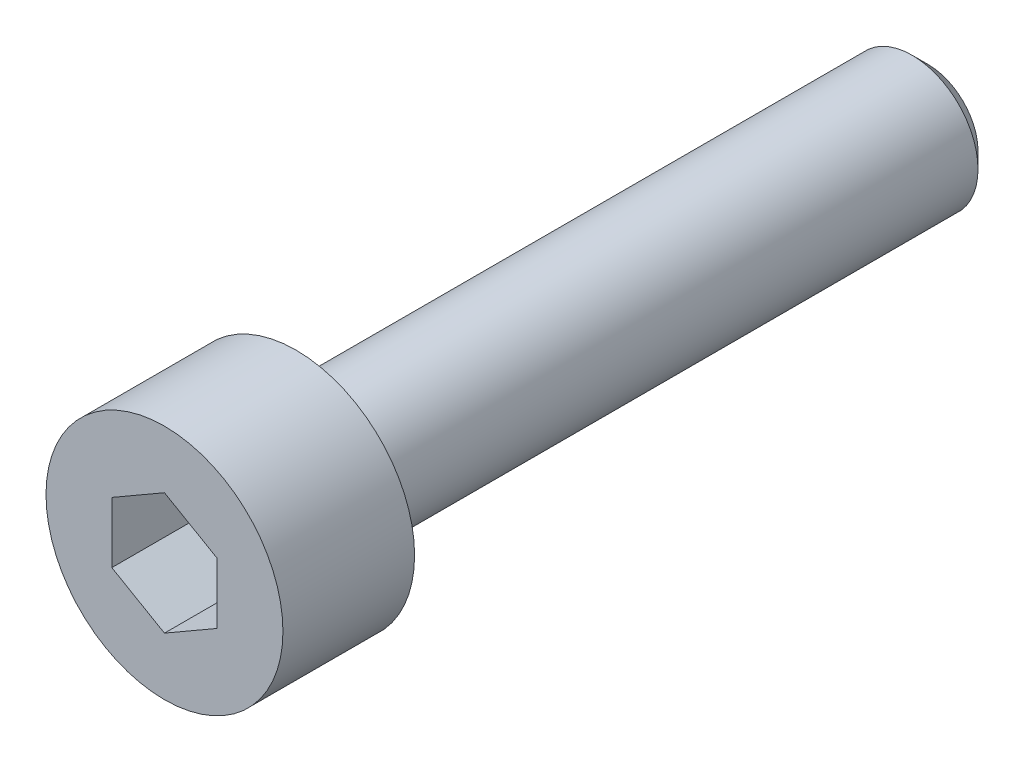
ISO-10303-21;
HEADER;
FILE_DESCRIPTION(('STEP AP214'),'2;1');
FILE_NAME('part.step','',(''),(''),'','','');
FILE_SCHEMA(('AUTOMOTIVE_DESIGN { 1 0 10303 214 1 1 1 1 }'));
ENDSEC;
DATA;
#1=APPLICATION_CONTEXT('core data for automotive mechanical design processes');
#2=APPLICATION_PROTOCOL_DEFINITION('international standard','automotive_design',2000,#1);
#3=PRODUCT_CONTEXT('',#1,'mechanical');
#4=PRODUCT('Part','Part','',(#3));
#5=PRODUCT_RELATED_PRODUCT_CATEGORY('part','',(#4));
#6=PRODUCT_DEFINITION_FORMATION('','',#4);
#7=PRODUCT_DEFINITION_CONTEXT('part definition',#1,'design');
#8=PRODUCT_DEFINITION('design','',#6,#7);
#9=PRODUCT_DEFINITION_SHAPE('','',#8);
#10=(LENGTH_UNIT() NAMED_UNIT(*) SI_UNIT(.MILLI.,.METRE.));
#11=(NAMED_UNIT(*) PLANE_ANGLE_UNIT() SI_UNIT($,.RADIAN.));
#12=(NAMED_UNIT(*) SI_UNIT($,.STERADIAN.) SOLID_ANGLE_UNIT());
#13=UNCERTAINTY_MEASURE_WITH_UNIT(LENGTH_MEASURE(1.E-05),#10,'distance_accuracy_value','');
#14=(GEOMETRIC_REPRESENTATION_CONTEXT(3) GLOBAL_UNCERTAINTY_ASSIGNED_CONTEXT((#13)) GLOBAL_UNIT_ASSIGNED_CONTEXT((#10,
#11,#12)) REPRESENTATION_CONTEXT('',''));
#15=CARTESIAN_POINT('',(0.,0.,0.));
#16=DIRECTION('',(0.,0.,1.));
#17=DIRECTION('',(1.,0.,0.));
#18=AXIS2_PLACEMENT_3D('',#15,#16,#17);
#19=CARTESIAN_POINT('',(0.,0.,0.));
#20=DIRECTION('',(0.,0.,1.));
#21=DIRECTION('',(1.,0.,0.));
#22=AXIS2_PLACEMENT_3D('',#19,#20,#21);
#23=PLANE('',#22);
#24=CARTESIAN_POINT('',(0.,0.,0.));
#25=DIRECTION('',(0.,0.,1.));
#26=DIRECTION('',(1.,0.,0.));
#27=AXIS2_PLACEMENT_3D('',#24,#25,#26);
#28=CIRCLE('',#27,2.25);
#29=CARTESIAN_POINT('',(2.25,0.,0.));
#30=VERTEX_POINT('',#29);
#31=EDGE_CURVE('E135',#30,#30,#28,.T.);
#32=ORIENTED_EDGE('',*,*,#31,.F.);
#33=EDGE_LOOP('',(#32));
#34=FACE_BOUND('',#33,.T.);
#35=CARTESIAN_POINT('',(0.,0.,0.));
#36=DIRECTION('',(0.,0.,1.));
#37=DIRECTION('',(1.,0.,0.));
#38=AXIS2_PLACEMENT_3D('',#35,#36,#37);
#39=CIRCLE('',#38,1.25);
#40=CARTESIAN_POINT('',(1.25,0.,0.));
#41=VERTEX_POINT('',#40);
#42=EDGE_CURVE('E144',#41,#41,#39,.F.);
#43=ORIENTED_EDGE('',*,*,#42,.F.);
#44=EDGE_LOOP('',(#43));
#45=FACE_BOUND('',#44,.T.);
#46=ADVANCED_FACE('F33',(#34,#45),#23,.F.);
#47=CARTESIAN_POINT('',(0.,0.,2.5));
#48=DIRECTION('',(0.,0.,-1.));
#49=DIRECTION('',(-1.,0.,0.));
#50=AXIS2_PLACEMENT_3D('',#47,#48,#49);
#51=CYLINDRICAL_SURFACE('',#50,2.25);
#52=CARTESIAN_POINT('',(0.,0.,2.5));
#53=DIRECTION('',(0.,0.,1.));
#54=DIRECTION('',(1.,0.,0.));
#55=AXIS2_PLACEMENT_3D('',#52,#53,#54);
#56=CIRCLE('',#55,2.25);
#57=CARTESIAN_POINT('',(2.25,0.,2.5));
#58=VERTEX_POINT('',#57);
#59=EDGE_CURVE('E141',#58,#58,#56,.T.);
#60=ORIENTED_EDGE('',*,*,#59,.F.);
#61=EDGE_LOOP('',(#60));
#62=FACE_BOUND('',#61,.T.);
#63=ORIENTED_EDGE('',*,*,#31,.T.);
#64=EDGE_LOOP('',(#63));
#65=FACE_BOUND('',#64,.T.);
#66=ADVANCED_FACE('F166',(#62,#65),#51,.T.);
#67=CARTESIAN_POINT('',(0.,0.,2.5));
#68=DIRECTION('',(0.,0.,1.));
#69=DIRECTION('',(1.,0.,0.));
#70=AXIS2_PLACEMENT_3D('',#67,#68,#69);
#71=PLANE('',#70);
#72=DIRECTION('',(-0.866025403784439,0.5,0.));
#73=VECTOR('',#72,1.);
#74=CARTESIAN_POINT('',(0.999999999999999,0.577350269189626,2.5));
#75=LINE('',#74,#73);
#76=CARTESIAN_POINT('',(0.999999999999999,0.577350269189626,2.5));
#77=VERTEX_POINT('',#76);
#78=CARTESIAN_POINT('',(0.,1.15470053837925,2.5));
#79=VERTEX_POINT('',#78);
#80=EDGE_CURVE('E48',#77,#79,#75,.T.);
#81=ORIENTED_EDGE('',*,*,#80,.F.);
#82=DIRECTION('',(0.,1.,0.));
#83=VECTOR('',#82,1.);
#84=CARTESIAN_POINT('',(0.999999999999999,-0.577350269189626,2.5));
#85=LINE('',#84,#83);
#86=CARTESIAN_POINT('',(0.999999999999999,-0.577350269189626,2.5));
#87=VERTEX_POINT('',#86);
#88=EDGE_CURVE('E131',#87,#77,#85,.T.);
#89=ORIENTED_EDGE('',*,*,#88,.F.);
#90=DIRECTION('',(0.866025403784439,0.5,0.));
#91=VECTOR('',#90,1.);
#92=CARTESIAN_POINT('',(0.,-1.15470053837925,2.5));
#93=LINE('',#92,#91);
#94=CARTESIAN_POINT('',(0.,-1.15470053837925,2.5));
#95=VERTEX_POINT('',#94);
#96=EDGE_CURVE('E129',#95,#87,#93,.T.);
#97=ORIENTED_EDGE('',*,*,#96,.F.);
#98=DIRECTION('',(0.866025403784438,-0.5,0.));
#99=VECTOR('',#98,1.);
#100=CARTESIAN_POINT('',(-1.,-0.577350269189626,2.5));
#101=LINE('',#100,#99);
#102=CARTESIAN_POINT('',(-1.,-0.577350269189626,2.5));
#103=VERTEX_POINT('',#102);
#104=EDGE_CURVE('E96',#103,#95,#101,.T.);
#105=ORIENTED_EDGE('',*,*,#104,.F.);
#106=DIRECTION('',(0.,-1.,0.));
#107=VECTOR('',#106,1.);
#108=CARTESIAN_POINT('',(-1.,0.577350269189626,2.5));
#109=LINE('',#108,#107);
#110=CARTESIAN_POINT('',(-1.,0.577350269189626,2.5));
#111=VERTEX_POINT('',#110);
#112=EDGE_CURVE('E125',#111,#103,#109,.T.);
#113=ORIENTED_EDGE('',*,*,#112,.F.);
#114=DIRECTION('',(-0.866025403784439,-0.5,0.));
#115=VECTOR('',#114,1.);
#116=CARTESIAN_POINT('',(0.,1.15470053837925,2.5));
#117=LINE('',#116,#115);
#118=EDGE_CURVE('E122',#79,#111,#117,.T.);
#119=ORIENTED_EDGE('',*,*,#118,.F.);
#120=EDGE_LOOP('',(#81,#89,#97,#105,#113,#119));
#121=FACE_BOUND('',#120,.T.);
#122=ORIENTED_EDGE('',*,*,#59,.T.);
#123=EDGE_LOOP('',(#122));
#124=FACE_BOUND('',#123,.T.);
#125=ADVANCED_FACE('F172',(#121,#124),#71,.T.);
#126=CARTESIAN_POINT('',(0.,0.,-12.));
#127=DIRECTION('',(0.,0.,1.));
#128=DIRECTION('',(1.,0.,0.));
#129=AXIS2_PLACEMENT_3D('',#126,#127,#128);
#130=CYLINDRICAL_SURFACE('',#129,1.25);
#131=CARTESIAN_POINT('',(0.,0.,-11.7));
#132=DIRECTION('',(0.,0.,-1.));
#133=DIRECTION('',(-1.,0.,0.));
#134=AXIS2_PLACEMENT_3D('',#131,#132,#133);
#135=CIRCLE('',#134,1.25);
#136=CARTESIAN_POINT('',(-1.25,0.,-11.7));
#137=VERTEX_POINT('',#136);
#138=EDGE_CURVE('E11',#137,#137,#135,.F.);
#139=ORIENTED_EDGE('',*,*,#138,.T.);
#140=EDGE_LOOP('',(#139));
#141=FACE_BOUND('',#140,.T.);
#142=ORIENTED_EDGE('',*,*,#42,.T.);
#143=EDGE_LOOP('',(#142));
#144=FACE_BOUND('',#143,.T.);
#145=ADVANCED_FACE('F162',(#141,#144),#130,.T.);
#146=CARTESIAN_POINT('',(0.,0.,-12.));
#147=DIRECTION('',(0.,0.,-1.));
#148=DIRECTION('',(-1.,0.,0.));
#149=AXIS2_PLACEMENT_3D('',#146,#147,#148);
#150=PLANE('',#149);
#151=CARTESIAN_POINT('',(0.,0.,-12.));
#152=DIRECTION('',(0.,0.,-1.));
#153=DIRECTION('',(-1.,0.,0.));
#154=AXIS2_PLACEMENT_3D('',#151,#152,#153);
#155=CIRCLE('',#154,0.95);
#156=CARTESIAN_POINT('',(-0.95,0.,-12.));
#157=VERTEX_POINT('',#156);
#158=EDGE_CURVE('E41',#157,#157,#155,.T.);
#159=ORIENTED_EDGE('',*,*,#158,.T.);
#160=EDGE_LOOP('',(#159));
#161=FACE_BOUND('',#160,.T.);
#162=ADVANCED_FACE('F151',(#161),#150,.T.);
#163=CARTESIAN_POINT('',(0.,0.,-12.));
#164=DIRECTION('',(0.,0.,1.));
#165=DIRECTION('',(1.,0.,0.));
#166=AXIS2_PLACEMENT_3D('',#163,#164,#165);
#167=CONICAL_SURFACE('',#166,0.95,0.785398163397449);
#168=ORIENTED_EDGE('',*,*,#138,.F.);
#169=EDGE_LOOP('',(#168));
#170=FACE_BOUND('',#169,.T.);
#171=ORIENTED_EDGE('',*,*,#158,.F.);
#172=EDGE_LOOP('',(#171));
#173=FACE_BOUND('',#172,.T.);
#174=ADVANCED_FACE('F35',(#170,#173),#167,.T.);
#175=CARTESIAN_POINT('',(0.999999999999999,0.577350269189626,0.5));
#176=DIRECTION('',(0.5,0.866025403784439,0.));
#177=DIRECTION('',(-0.866025403784439,0.5,0.));
#178=AXIS2_PLACEMENT_3D('',#175,#176,#177);
#179=PLANE('',#178);
#180=ORIENTED_EDGE('',*,*,#80,.T.);
#181=DIRECTION('',(0.,0.,1.));
#182=VECTOR('',#181,1.);
#183=CARTESIAN_POINT('',(0.,1.15470053837925,0.5));
#184=LINE('',#183,#182);
#185=CARTESIAN_POINT('',(0.,1.15470053837925,0.5));
#186=VERTEX_POINT('',#185);
#187=EDGE_CURVE('E78',#186,#79,#184,.T.);
#188=ORIENTED_EDGE('',*,*,#187,.F.);
#189=DIRECTION('',(-0.866025403784439,0.5,0.));
#190=VECTOR('',#189,1.);
#191=CARTESIAN_POINT('',(0.999999999999999,0.577350269189626,0.5));
#192=LINE('',#191,#190);
#193=CARTESIAN_POINT('',(0.999999999999999,0.577350269189626,0.5));
#194=VERTEX_POINT('',#193);
#195=EDGE_CURVE('E133',#194,#186,#192,.T.);
#196=ORIENTED_EDGE('',*,*,#195,.F.);
#197=DIRECTION('',(0.,0.,1.));
#198=VECTOR('',#197,1.);
#199=CARTESIAN_POINT('',(0.999999999999999,0.577350269189626,0.5));
#200=LINE('',#199,#198);
#201=EDGE_CURVE('E56',#194,#77,#200,.T.);
#202=ORIENTED_EDGE('',*,*,#201,.T.);
#203=EDGE_LOOP('',(#180,#188,#196,#202));
#204=FACE_BOUND('',#203,.T.);
#205=ADVANCED_FACE('F154',(#204),#179,.F.);
#206=CARTESIAN_POINT('',(0.999999999999999,-0.577350269189626,0.5));
#207=DIRECTION('',(1.,0.,0.));
#208=DIRECTION('',(0.,1.,0.));
#209=AXIS2_PLACEMENT_3D('',#206,#207,#208);
#210=PLANE('',#209);
#211=ORIENTED_EDGE('',*,*,#88,.T.);
#212=ORIENTED_EDGE('',*,*,#201,.F.);
#213=DIRECTION('',(0.,1.,0.));
#214=VECTOR('',#213,1.);
#215=CARTESIAN_POINT('',(0.999999999999999,-0.577350269189626,0.5));
#216=LINE('',#215,#214);
#217=CARTESIAN_POINT('',(0.999999999999999,-0.577350269189626,0.5));
#218=VERTEX_POINT('',#217);
#219=EDGE_CURVE('E108',#218,#194,#216,.T.);
#220=ORIENTED_EDGE('',*,*,#219,.F.);
#221=DIRECTION('',(0.,0.,1.));
#222=VECTOR('',#221,1.);
#223=CARTESIAN_POINT('',(0.999999999999999,-0.577350269189626,0.5));
#224=LINE('',#223,#222);
#225=EDGE_CURVE('E100',#218,#87,#224,.T.);
#226=ORIENTED_EDGE('',*,*,#225,.T.);
#227=EDGE_LOOP('',(#211,#212,#220,#226));
#228=FACE_BOUND('',#227,.T.);
#229=ADVANCED_FACE('F160',(#228),#210,.F.);
#230=CARTESIAN_POINT('',(0.,-1.15470053837925,0.5));
#231=DIRECTION('',(0.5,-0.866025403784439,0.));
#232=DIRECTION('',(0.866025403784439,0.5,0.));
#233=AXIS2_PLACEMENT_3D('',#230,#231,#232);
#234=PLANE('',#233);
#235=ORIENTED_EDGE('',*,*,#96,.T.);
#236=ORIENTED_EDGE('',*,*,#225,.F.);
#237=DIRECTION('',(0.866025403784439,0.5,0.));
#238=VECTOR('',#237,1.);
#239=CARTESIAN_POINT('',(0.,-1.15470053837925,0.5));
#240=LINE('',#239,#238);
#241=CARTESIAN_POINT('',(0.,-1.15470053837925,0.5));
#242=VERTEX_POINT('',#241);
#243=EDGE_CURVE('E104',#242,#218,#240,.T.);
#244=ORIENTED_EDGE('',*,*,#243,.F.);
#245=DIRECTION('',(0.,0.,1.));
#246=VECTOR('',#245,1.);
#247=CARTESIAN_POINT('',(0.,-1.15470053837925,0.5));
#248=LINE('',#247,#246);
#249=EDGE_CURVE('E89',#242,#95,#248,.T.);
#250=ORIENTED_EDGE('',*,*,#249,.T.);
#251=EDGE_LOOP('',(#235,#236,#244,#250));
#252=FACE_BOUND('',#251,.T.);
#253=ADVANCED_FACE('F105',(#252),#234,.F.);
#254=CARTESIAN_POINT('',(-1.,-0.577350269189626,0.5));
#255=DIRECTION('',(-0.5,-0.866025403784439,0.));
#256=DIRECTION('',(0.866025403784438,-0.5,0.));
#257=AXIS2_PLACEMENT_3D('',#254,#255,#256);
#258=PLANE('',#257);
#259=ORIENTED_EDGE('',*,*,#104,.T.);
#260=ORIENTED_EDGE('',*,*,#249,.F.);
#261=DIRECTION('',(0.866025403784438,-0.5,0.));
#262=VECTOR('',#261,1.);
#263=CARTESIAN_POINT('',(-1.,-0.577350269189626,0.5));
#264=LINE('',#263,#262);
#265=CARTESIAN_POINT('',(-1.,-0.577350269189626,0.5));
#266=VERTEX_POINT('',#265);
#267=EDGE_CURVE('E93',#266,#242,#264,.T.);
#268=ORIENTED_EDGE('',*,*,#267,.F.);
#269=DIRECTION('',(0.,0.,1.));
#270=VECTOR('',#269,1.);
#271=CARTESIAN_POINT('',(-1.,-0.577350269189626,0.5));
#272=LINE('',#271,#270);
#273=EDGE_CURVE('E101',#266,#103,#272,.T.);
#274=ORIENTED_EDGE('',*,*,#273,.T.);
#275=EDGE_LOOP('',(#259,#260,#268,#274));
#276=FACE_BOUND('',#275,.T.);
#277=ADVANCED_FACE('F91',(#276),#258,.F.);
#278=CARTESIAN_POINT('',(-1.,0.577350269189626,0.5));
#279=DIRECTION('',(-1.,0.,0.));
#280=DIRECTION('',(0.,0.,1.));
#281=AXIS2_PLACEMENT_3D('',#278,#279,#280);
#282=PLANE('',#281);
#283=ORIENTED_EDGE('',*,*,#112,.T.);
#284=ORIENTED_EDGE('',*,*,#273,.F.);
#285=DIRECTION('',(0.,-1.,0.));
#286=VECTOR('',#285,1.);
#287=CARTESIAN_POINT('',(-1.,0.577350269189626,0.5));
#288=LINE('',#287,#286);
#289=CARTESIAN_POINT('',(-1.,0.577350269189626,0.5));
#290=VERTEX_POINT('',#289);
#291=EDGE_CURVE('E114',#290,#266,#288,.T.);
#292=ORIENTED_EDGE('',*,*,#291,.F.);
#293=DIRECTION('',(0.,0.,1.));
#294=VECTOR('',#293,1.);
#295=CARTESIAN_POINT('',(-1.,0.577350269189626,0.5));
#296=LINE('',#295,#294);
#297=EDGE_CURVE('E138',#290,#111,#296,.T.);
#298=ORIENTED_EDGE('',*,*,#297,.T.);
#299=EDGE_LOOP('',(#283,#284,#292,#298));
#300=FACE_BOUND('',#299,.T.);
#301=ADVANCED_FACE('F186',(#300),#282,.F.);
#302=CARTESIAN_POINT('',(0.,1.15470053837925,0.5));
#303=DIRECTION('',(-0.5,0.866025403784439,0.));
#304=DIRECTION('',(-0.866025403784439,-0.5,0.));
#305=AXIS2_PLACEMENT_3D('',#302,#303,#304);
#306=PLANE('',#305);
#307=ORIENTED_EDGE('',*,*,#118,.T.);
#308=ORIENTED_EDGE('',*,*,#297,.F.);
#309=DIRECTION('',(-0.866025403784439,-0.5,0.));
#310=VECTOR('',#309,1.);
#311=CARTESIAN_POINT('',(0.,1.15470053837925,0.5));
#312=LINE('',#311,#310);
#313=EDGE_CURVE('E116',#186,#290,#312,.T.);
#314=ORIENTED_EDGE('',*,*,#313,.F.);
#315=ORIENTED_EDGE('',*,*,#187,.T.);
#316=EDGE_LOOP('',(#307,#308,#314,#315));
#317=FACE_BOUND('',#316,.T.);
#318=ADVANCED_FACE('F183',(#317),#306,.F.);
#319=CARTESIAN_POINT('',(0.,0.,0.5));
#320=DIRECTION('',(0.,0.,1.));
#321=DIRECTION('',(1.,0.,0.));
#322=AXIS2_PLACEMENT_3D('',#319,#320,#321);
#323=PLANE('',#322);
#324=ORIENTED_EDGE('',*,*,#195,.T.);
#325=ORIENTED_EDGE('',*,*,#313,.T.);
#326=ORIENTED_EDGE('',*,*,#291,.T.);
#327=ORIENTED_EDGE('',*,*,#267,.T.);
#328=ORIENTED_EDGE('',*,*,#243,.T.);
#329=ORIENTED_EDGE('',*,*,#219,.T.);
#330=EDGE_LOOP('',(#324,#325,#326,#327,#328,#329));
#331=FACE_BOUND('',#330,.T.);
#332=ADVANCED_FACE('F111',(#331),#323,.T.);
#333=CLOSED_SHELL('',(#46,#66,#125,#145,#162,#174,#205,#229,#253,#277,#301,#318,#332));
#334=MANIFOLD_SOLID_BREP('B2',#333);
#335=ADVANCED_BREP_SHAPE_REPRESENTATION('',(#18,#334),#14);
#336=SHAPE_DEFINITION_REPRESENTATION(#9,#335);
ENDSEC;
END-ISO-10303-21;
